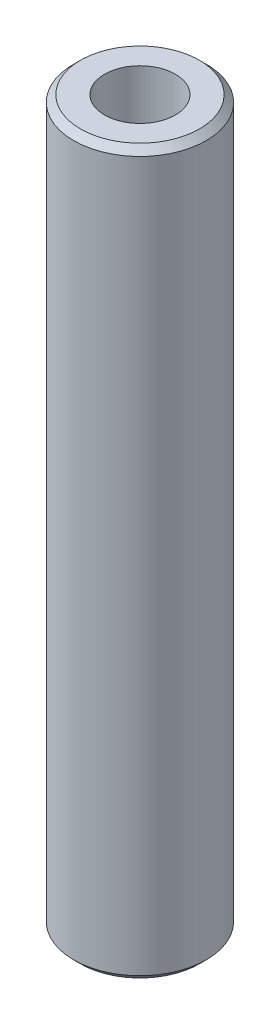
ISO-10303-21;
HEADER;
FILE_DESCRIPTION(('STEP AP214'),'2;1');
FILE_NAME('part.step','',(''),(''),'','','');
FILE_SCHEMA(('AUTOMOTIVE_DESIGN { 1 0 10303 214 1 1 1 1 }'));
ENDSEC;
DATA;
#1=APPLICATION_CONTEXT('core data for automotive mechanical design processes');
#2=APPLICATION_PROTOCOL_DEFINITION('international standard','automotive_design',2000,#1);
#3=PRODUCT_CONTEXT('',#1,'mechanical');
#4=PRODUCT('Part','Part','',(#3));
#5=PRODUCT_RELATED_PRODUCT_CATEGORY('part','',(#4));
#6=PRODUCT_DEFINITION_FORMATION('','',#4);
#7=PRODUCT_DEFINITION_CONTEXT('part definition',#1,'design');
#8=PRODUCT_DEFINITION('design','',#6,#7);
#9=PRODUCT_DEFINITION_SHAPE('','',#8);
#10=(LENGTH_UNIT() NAMED_UNIT(*) SI_UNIT(.MILLI.,.METRE.));
#11=(NAMED_UNIT(*) PLANE_ANGLE_UNIT() SI_UNIT($,.RADIAN.));
#12=(NAMED_UNIT(*) SI_UNIT($,.STERADIAN.) SOLID_ANGLE_UNIT());
#13=UNCERTAINTY_MEASURE_WITH_UNIT(LENGTH_MEASURE(1.E-05),#10,'distance_accuracy_value','');
#14=(GEOMETRIC_REPRESENTATION_CONTEXT(3) GLOBAL_UNCERTAINTY_ASSIGNED_CONTEXT((#13)) GLOBAL_UNIT_ASSIGNED_CONTEXT((#10,
#11,#12)) REPRESENTATION_CONTEXT('',''));
#15=CARTESIAN_POINT('',(0.,0.,0.));
#16=DIRECTION('',(0.,0.,1.));
#17=DIRECTION('',(1.,0.,0.));
#18=AXIS2_PLACEMENT_3D('',#15,#16,#17);
#19=CARTESIAN_POINT('',(0.,600.,0.));
#20=DIRECTION('',(0.,-1.,0.));
#21=DIRECTION('',(0.,0.,-1.));
#22=AXIS2_PLACEMENT_3D('',#19,#20,#21);
#23=CYLINDRICAL_SURFACE('',#22,55.);
#24=CARTESIAN_POINT('',(0.,594.399993475546,0.));
#25=DIRECTION('',(0.,1.,0.));
#26=DIRECTION('',(0.,0.,1.));
#27=AXIS2_PLACEMENT_3D('',#24,#25,#26);
#28=CIRCLE('',#27,55.);
#29=CARTESIAN_POINT('',(0.,594.399993475546,55.));
#30=VERTEX_POINT('',#29);
#31=EDGE_CURVE('E50',#30,#30,#28,.F.);
#32=ORIENTED_EDGE('',*,*,#31,.T.);
#33=EDGE_LOOP('',(#32));
#34=FACE_BOUND('',#33,.T.);
#35=CARTESIAN_POINT('',(0.,5.60000652445358,0.));
#36=DIRECTION('',(0.,1.,0.));
#37=DIRECTION('',(0.,0.,1.));
#38=AXIS2_PLACEMENT_3D('',#35,#36,#37);
#39=CIRCLE('',#38,55.);
#40=CARTESIAN_POINT('',(0.,5.60000652445358,55.));
#41=VERTEX_POINT('',#40);
#42=EDGE_CURVE('E51',#41,#41,#39,.T.);
#43=ORIENTED_EDGE('',*,*,#42,.T.);
#44=EDGE_LOOP('',(#43));
#45=FACE_BOUND('',#44,.T.);
#46=ADVANCED_FACE('F39',(#34,#45),#23,.T.);
#47=CARTESIAN_POINT('',(0.,600.,0.));
#48=DIRECTION('',(0.,1.,0.));
#49=DIRECTION('',(0.,0.,1.));
#50=AXIS2_PLACEMENT_3D('',#47,#48,#49);
#51=PLANE('',#50);
#52=CARTESIAN_POINT('',(0.,600.,0.));
#53=DIRECTION('',(0.,1.,0.));
#54=DIRECTION('',(0.,0.,1.));
#55=AXIS2_PLACEMENT_3D('',#52,#53,#54);
#56=CIRCLE('',#55,49.3999934755463);
#57=CARTESIAN_POINT('',(0.,600.,49.3999934755463));
#58=VERTEX_POINT('',#57);
#59=EDGE_CURVE('E54',#58,#58,#56,.T.);
#60=ORIENTED_EDGE('',*,*,#59,.T.);
#61=EDGE_LOOP('',(#60));
#62=FACE_BOUND('',#61,.T.);
#63=CARTESIAN_POINT('',(0.,600.,0.));
#64=DIRECTION('',(0.,1.,0.));
#65=DIRECTION('',(0.,0.,1.));
#66=AXIS2_PLACEMENT_3D('',#63,#64,#65);
#67=CIRCLE('',#66,29.3648258007249);
#68=CARTESIAN_POINT('',(0.,600.,29.3648258007249));
#69=VERTEX_POINT('',#68);
#70=EDGE_CURVE('E58',#69,#69,#67,.T.);
#71=ORIENTED_EDGE('',*,*,#70,.F.);
#72=EDGE_LOOP('',(#71));
#73=FACE_BOUND('',#72,.T.);
#74=ADVANCED_FACE('F69',(#62,#73),#51,.T.);
#75=CARTESIAN_POINT('',(0.,0.,0.));
#76=DIRECTION('',(0.,1.,0.));
#77=DIRECTION('',(0.,0.,1.));
#78=AXIS2_PLACEMENT_3D('',#75,#76,#77);
#79=PLANE('',#78);
#80=CARTESIAN_POINT('',(0.,0.,0.));
#81=DIRECTION('',(0.,1.,0.));
#82=DIRECTION('',(0.,0.,1.));
#83=AXIS2_PLACEMENT_3D('',#80,#81,#82);
#84=CIRCLE('',#83,49.3999934755463);
#85=CARTESIAN_POINT('',(0.,0.,49.3999934755463));
#86=VERTEX_POINT('',#85);
#87=EDGE_CURVE('E10',#86,#86,#84,.F.);
#88=ORIENTED_EDGE('',*,*,#87,.T.);
#89=EDGE_LOOP('',(#88));
#90=FACE_BOUND('',#89,.T.);
#91=CARTESIAN_POINT('',(0.,0.,0.));
#92=DIRECTION('',(0.,1.,0.));
#93=DIRECTION('',(0.,0.,1.));
#94=AXIS2_PLACEMENT_3D('',#91,#92,#93);
#95=CIRCLE('',#94,29.3648258007249);
#96=CARTESIAN_POINT('',(0.,0.,29.3648258007249));
#97=VERTEX_POINT('',#96);
#98=EDGE_CURVE('E63',#97,#97,#95,.T.);
#99=ORIENTED_EDGE('',*,*,#98,.T.);
#100=EDGE_LOOP('',(#99));
#101=FACE_BOUND('',#100,.T.);
#102=ADVANCED_FACE('F75',(#90,#101),#79,.F.);
#103=CARTESIAN_POINT('',(0.,600.,0.));
#104=DIRECTION('',(0.,-1.,0.));
#105=DIRECTION('',(0.,0.,-1.));
#106=AXIS2_PLACEMENT_3D('',#103,#104,#105);
#107=CYLINDRICAL_SURFACE('',#106,29.3648258007249);
#108=ORIENTED_EDGE('',*,*,#70,.T.);
#109=EDGE_LOOP('',(#108));
#110=FACE_BOUND('',#109,.T.);
#111=ORIENTED_EDGE('',*,*,#98,.F.);
#112=EDGE_LOOP('',(#111));
#113=FACE_BOUND('',#112,.T.);
#114=ADVANCED_FACE('F70',(#110,#113),#107,.F.);
#115=CARTESIAN_POINT('',(0.,600.,0.));
#116=DIRECTION('',(0.,-1.,0.));
#117=DIRECTION('',(0.,0.,-1.));
#118=AXIS2_PLACEMENT_3D('',#115,#116,#117);
#119=CONICAL_SURFACE('',#118,49.3999934755463,0.785398163397454);
#120=ORIENTED_EDGE('',*,*,#31,.F.);
#121=EDGE_LOOP('',(#120));
#122=FACE_BOUND('',#121,.T.);
#123=ORIENTED_EDGE('',*,*,#59,.F.);
#124=EDGE_LOOP('',(#123));
#125=FACE_BOUND('',#124,.T.);
#126=ADVANCED_FACE('F81',(#122,#125),#119,.T.);
#127=CARTESIAN_POINT('',(0.,5.60000652445358,0.));
#128=DIRECTION('',(0.,1.,0.));
#129=DIRECTION('',(0.,0.,1.));
#130=AXIS2_PLACEMENT_3D('',#127,#128,#129);
#131=CONICAL_SURFACE('',#130,55.,0.785398163397459);
#132=ORIENTED_EDGE('',*,*,#87,.F.);
#133=EDGE_LOOP('',(#132));
#134=FACE_BOUND('',#133,.T.);
#135=ORIENTED_EDGE('',*,*,#42,.F.);
#136=EDGE_LOOP('',(#135));
#137=FACE_BOUND('',#136,.T.);
#138=ADVANCED_FACE('F45',(#134,#137),#131,.T.);
#139=CLOSED_SHELL('',(#46,#74,#102,#114,#126,#138));
#140=MANIFOLD_SOLID_BREP('B2',#139);
#141=ADVANCED_BREP_SHAPE_REPRESENTATION('',(#18,#140),#14);
#142=SHAPE_DEFINITION_REPRESENTATION(#9,#141);
ENDSEC;
END-ISO-10303-21;
